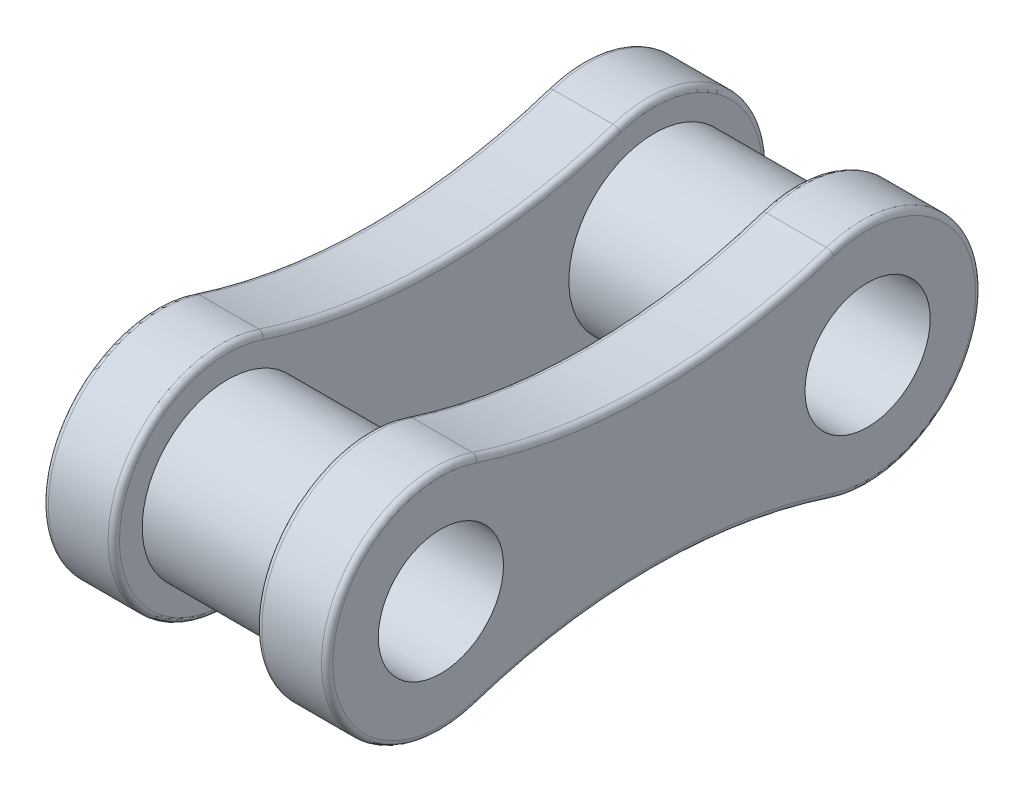
ISO-10303-21;
HEADER;
FILE_DESCRIPTION(('STEP AP214'),'2;1');
FILE_NAME('part.step','',(''),(''),'','','');
FILE_SCHEMA(('AUTOMOTIVE_DESIGN { 1 0 10303 214 1 1 1 1 }'));
ENDSEC;
DATA;
#1=APPLICATION_CONTEXT('core data for automotive mechanical design processes');
#2=APPLICATION_PROTOCOL_DEFINITION('international standard','automotive_design',2000,#1);
#3=PRODUCT_CONTEXT('',#1,'mechanical');
#4=PRODUCT('Part','Part','',(#3));
#5=PRODUCT_RELATED_PRODUCT_CATEGORY('part','',(#4));
#6=PRODUCT_DEFINITION_FORMATION('','',#4);
#7=PRODUCT_DEFINITION_CONTEXT('part definition',#1,'design');
#8=PRODUCT_DEFINITION('design','',#6,#7);
#9=PRODUCT_DEFINITION_SHAPE('','',#8);
#10=(LENGTH_UNIT() NAMED_UNIT(*) SI_UNIT(.MILLI.,.METRE.));
#11=(NAMED_UNIT(*) PLANE_ANGLE_UNIT() SI_UNIT($,.RADIAN.));
#12=(NAMED_UNIT(*) SI_UNIT($,.STERADIAN.) SOLID_ANGLE_UNIT());
#13=UNCERTAINTY_MEASURE_WITH_UNIT(LENGTH_MEASURE(1.E-05),#10,'distance_accuracy_value','');
#14=(GEOMETRIC_REPRESENTATION_CONTEXT(3) GLOBAL_UNCERTAINTY_ASSIGNED_CONTEXT((#13)) GLOBAL_UNIT_ASSIGNED_CONTEXT((#10,
#11,#12)) REPRESENTATION_CONTEXT('',''));
#15=CARTESIAN_POINT('',(0.,0.,0.));
#16=DIRECTION('',(0.,0.,1.));
#17=DIRECTION('',(1.,0.,0.));
#18=AXIS2_PLACEMENT_3D('',#15,#16,#17);
#19=CARTESIAN_POINT('',(6.35,-28.9534933125521,-9.525));
#20=DIRECTION('',(1.,0.,0.));
#21=DIRECTION('',(0.,0.,-1.));
#22=AXIS2_PLACEMENT_3D('',#19,#20,#21);
#23=PLANE('',#22);
#24=CARTESIAN_POINT('',(6.35,-57.9069866251042,-19.05));
#25=DIRECTION('',(1.,0.,0.));
#26=DIRECTION('',(0.,0.,-1.));
#27=AXIS2_PLACEMENT_3D('',#24,#25,#26);
#28=CIRCLE('',#27,51.308);
#29=CARTESIAN_POINT('',(6.35,-9.16860621564149,-35.08375));
#30=VERTEX_POINT('',#29);
#31=CARTESIAN_POINT('',(6.35,-9.1686062156415,-3.01624999999999));
#32=VERTEX_POINT('',#31);
#33=EDGE_CURVE('E326',#30,#32,#28,.T.);
#34=ORIENTED_EDGE('',*,*,#33,.T.);
#35=CARTESIAN_POINT('',(6.35,0.,0.));
#36=DIRECTION('',(1.,0.,0.));
#37=DIRECTION('',(0.,0.,-1.));
#38=AXIS2_PLACEMENT_3D('',#35,#36,#37);
#39=CIRCLE('',#38,9.65199999999999);
#40=CARTESIAN_POINT('',(6.35,9.12571738781709,-3.1436262751308));
#41=VERTEX_POINT('',#40);
#42=EDGE_CURVE('E319',#32,#41,#39,.F.);
#43=ORIENTED_EDGE('',*,*,#42,.T.);
#44=CARTESIAN_POINT('',(6.35,10.0863192181136,-3.47453430409194));
#45=DIRECTION('',(1.,0.,0.));
#46=DIRECTION('',(0.,0.,-1.));
#47=AXIS2_PLACEMENT_3D('',#44,#45,#46);
#48=CIRCLE('',#47,1.016);
#49=CARTESIAN_POINT('',(6.35,9.12025851420993,-3.15991911632581));
#50=VERTEX_POINT('',#49);
#51=EDGE_CURVE('E323',#50,#41,#48,.F.);
#52=ORIENTED_EDGE('',*,*,#51,.F.);
#53=CARTESIAN_POINT('',(6.35,57.9063240613461,-19.0479860985152));
#54=DIRECTION('',(1.,0.,0.));
#55=DIRECTION('',(0.,0.,-1.));
#56=AXIS2_PLACEMENT_3D('',#53,#54,#55);
#57=CIRCLE('',#56,51.308);
#58=CARTESIAN_POINT('',(6.35,9.16850130971312,-35.0834311322649));
#59=VERTEX_POINT('',#58);
#60=EDGE_CURVE('E332',#50,#59,#57,.T.);
#61=ORIENTED_EDGE('',*,*,#60,.T.);
#62=CARTESIAN_POINT('',(6.35,0.,-38.1));
#63=DIRECTION('',(1.,0.,0.));
#64=DIRECTION('',(0.,0.,-1.));
#65=AXIS2_PLACEMENT_3D('',#62,#63,#64);
#66=CIRCLE('',#65,9.65199999999999);
#67=EDGE_CURVE('E329',#59,#30,#66,.F.);
#68=ORIENTED_EDGE('',*,*,#67,.T.);
#69=EDGE_LOOP('',(#34,#43,#52,#61,#68));
#70=FACE_BOUND('',#69,.T.);
#71=CARTESIAN_POINT('',(6.35,0.,0.));
#72=DIRECTION('',(1.,0.,0.));
#73=DIRECTION('',(0.,0.,-1.));
#74=AXIS2_PLACEMENT_3D('',#71,#72,#73);
#75=CIRCLE('',#74,7.62);
#76=CARTESIAN_POINT('',(6.35,0.,-7.62));
#77=VERTEX_POINT('',#76);
#78=EDGE_CURVE('E422',#77,#77,#75,.T.);
#79=ORIENTED_EDGE('',*,*,#78,.T.);
#80=EDGE_LOOP('',(#79));
#81=FACE_BOUND('',#80,.T.);
#82=CARTESIAN_POINT('',(6.35,0.,-38.1));
#83=DIRECTION('',(1.,0.,0.));
#84=DIRECTION('',(0.,0.,-1.));
#85=AXIS2_PLACEMENT_3D('',#82,#83,#84);
#86=CIRCLE('',#85,7.62);
#87=CARTESIAN_POINT('',(6.35,0.,-45.72));
#88=VERTEX_POINT('',#87);
#89=EDGE_CURVE('E207',#88,#88,#86,.F.);
#90=ORIENTED_EDGE('',*,*,#89,.F.);
#91=EDGE_LOOP('',(#90));
#92=FACE_BOUND('',#91,.T.);
#93=ADVANCED_FACE('F44',(#70,#81,#92),#23,.F.);
#94=CARTESIAN_POINT('',(6.35,0.,0.));
#95=DIRECTION('',(-1.,0.,0.));
#96=DIRECTION('',(0.,0.,1.));
#97=AXIS2_PLACEMENT_3D('',#94,#95,#96);
#98=CYLINDRICAL_SURFACE('',#97,7.62);
#99=ORIENTED_EDGE('',*,*,#78,.F.);
#100=EDGE_LOOP('',(#99));
#101=FACE_BOUND('',#100,.T.);
#102=CARTESIAN_POINT('',(-6.35,0.,0.));
#103=DIRECTION('',(1.,0.,0.));
#104=DIRECTION('',(0.,0.,-1.));
#105=AXIS2_PLACEMENT_3D('',#102,#103,#104);
#106=CIRCLE('',#105,7.62);
#107=CARTESIAN_POINT('',(-6.35,0.,-7.62));
#108=VERTEX_POINT('',#107);
#109=EDGE_CURVE('E423',#108,#108,#106,.T.);
#110=ORIENTED_EDGE('',*,*,#109,.T.);
#111=EDGE_LOOP('',(#110));
#112=FACE_BOUND('',#111,.T.);
#113=ADVANCED_FACE('F490',(#101,#112),#98,.T.);
#114=CARTESIAN_POINT('',(6.35,0.,0.));
#115=DIRECTION('',(-1.,0.,0.));
#116=DIRECTION('',(0.,0.,1.));
#117=AXIS2_PLACEMENT_3D('',#114,#115,#116);
#118=CYLINDRICAL_SURFACE('',#117,5.588);
#119=CARTESIAN_POINT('',(12.7,0.,0.));
#120=DIRECTION('',(1.,0.,0.));
#121=DIRECTION('',(0.,0.,-1.));
#122=AXIS2_PLACEMENT_3D('',#119,#120,#121);
#123=CIRCLE('',#122,5.588);
#124=CARTESIAN_POINT('',(12.7,0.,-5.588));
#125=VERTEX_POINT('',#124);
#126=EDGE_CURVE('E427',#125,#125,#123,.T.);
#127=ORIENTED_EDGE('',*,*,#126,.T.);
#128=EDGE_LOOP('',(#127));
#129=FACE_BOUND('',#128,.T.);
#130=CARTESIAN_POINT('',(-12.7,0.,0.));
#131=DIRECTION('',(-1.,0.,0.));
#132=DIRECTION('',(0.,0.,1.));
#133=AXIS2_PLACEMENT_3D('',#130,#131,#132);
#134=CIRCLE('',#133,5.588);
#135=CARTESIAN_POINT('',(-12.7,0.,5.588));
#136=VERTEX_POINT('',#135);
#137=EDGE_CURVE('E248',#136,#136,#134,.T.);
#138=ORIENTED_EDGE('',*,*,#137,.T.);
#139=EDGE_LOOP('',(#138));
#140=FACE_BOUND('',#139,.T.);
#141=ADVANCED_FACE('F473',(#129,#140),#118,.F.);
#142=CARTESIAN_POINT('',(12.7,-28.9534933125521,-9.525));
#143=DIRECTION('',(1.,0.,0.));
#144=DIRECTION('',(0.,0.,-1.));
#145=AXIS2_PLACEMENT_3D('',#142,#143,#144);
#146=PLANE('',#145);
#147=CARTESIAN_POINT('',(12.7,10.0863192181136,-3.47453430409194));
#148=DIRECTION('',(1.,0.,0.));
#149=DIRECTION('',(0.,0.,-1.));
#150=AXIS2_PLACEMENT_3D('',#147,#148,#149);
#151=CIRCLE('',#150,1.016);
#152=CARTESIAN_POINT('',(12.7,9.12571738781709,-3.1436262751308));
#153=VERTEX_POINT('',#152);
#154=CARTESIAN_POINT('',(12.7,9.12025851420993,-3.15991911632581));
#155=VERTEX_POINT('',#154);
#156=EDGE_CURVE('E370',#153,#155,#151,.T.);
#157=ORIENTED_EDGE('',*,*,#156,.F.);
#158=CARTESIAN_POINT('',(12.7,0.,0.));
#159=DIRECTION('',(1.,0.,0.));
#160=DIRECTION('',(0.,0.,-1.));
#161=AXIS2_PLACEMENT_3D('',#158,#159,#160);
#162=CIRCLE('',#161,9.65199999999999);
#163=CARTESIAN_POINT('',(12.7,-9.1686062156415,-3.01624999999999));
#164=VERTEX_POINT('',#163);
#165=EDGE_CURVE('E357',#153,#164,#162,.T.);
#166=ORIENTED_EDGE('',*,*,#165,.T.);
#167=CARTESIAN_POINT('',(12.7,-57.9069866251042,-19.05));
#168=DIRECTION('',(1.,0.,0.));
#169=DIRECTION('',(0.,0.,-1.));
#170=AXIS2_PLACEMENT_3D('',#167,#168,#169);
#171=CIRCLE('',#170,51.308);
#172=CARTESIAN_POINT('',(12.7,-9.16860621564149,-35.08375));
#173=VERTEX_POINT('',#172);
#174=EDGE_CURVE('E361',#164,#173,#171,.F.);
#175=ORIENTED_EDGE('',*,*,#174,.T.);
#176=CARTESIAN_POINT('',(12.7,0.,-38.1));
#177=DIRECTION('',(1.,0.,0.));
#178=DIRECTION('',(0.,0.,-1.));
#179=AXIS2_PLACEMENT_3D('',#176,#177,#178);
#180=CIRCLE('',#179,9.65199999999999);
#181=CARTESIAN_POINT('',(12.7,9.16850130971312,-35.0834311322649));
#182=VERTEX_POINT('',#181);
#183=EDGE_CURVE('E364',#173,#182,#180,.T.);
#184=ORIENTED_EDGE('',*,*,#183,.T.);
#185=CARTESIAN_POINT('',(12.7,57.9063240613461,-19.0479860985152));
#186=DIRECTION('',(1.,0.,0.));
#187=DIRECTION('',(0.,0.,-1.));
#188=AXIS2_PLACEMENT_3D('',#185,#186,#187);
#189=CIRCLE('',#188,51.308);
#190=EDGE_CURVE('E367',#182,#155,#189,.F.);
#191=ORIENTED_EDGE('',*,*,#190,.T.);
#192=EDGE_LOOP('',(#157,#166,#175,#184,#191));
#193=FACE_BOUND('',#192,.T.);
#194=CARTESIAN_POINT('',(12.7,0.,-38.1));
#195=DIRECTION('',(1.,0.,0.));
#196=DIRECTION('',(0.,0.,-1.));
#197=AXIS2_PLACEMENT_3D('',#194,#195,#196);
#198=CIRCLE('',#197,5.588);
#199=CARTESIAN_POINT('',(12.7,0.,-43.688));
#200=VERTEX_POINT('',#199);
#201=EDGE_CURVE('E443',#200,#200,#198,.T.);
#202=ORIENTED_EDGE('',*,*,#201,.F.);
#203=EDGE_LOOP('',(#202));
#204=FACE_BOUND('',#203,.T.);
#205=ORIENTED_EDGE('',*,*,#126,.F.);
#206=EDGE_LOOP('',(#205));
#207=FACE_BOUND('',#206,.T.);
#208=ADVANCED_FACE('F501',(#193,#204,#207),#146,.T.);
#209=CARTESIAN_POINT('',(12.7,-57.9069866251042,-19.05));
#210=DIRECTION('',(-1.,0.,0.));
#211=DIRECTION('',(0.,0.,1.));
#212=AXIS2_PLACEMENT_3D('',#209,#210,#211);
#213=CYLINDRICAL_SURFACE('',#212,50.8);
#214=DIRECTION('',(-1.,0.,0.));
#215=VECTOR('',#214,1.);
#216=CARTESIAN_POINT('',(12.7,-9.65116443751736,-34.925));
#217=LINE('',#216,#215);
#218=CARTESIAN_POINT('',(12.192,-9.65116443751736,-34.925));
#219=VERTEX_POINT('',#218);
#220=CARTESIAN_POINT('',(6.858,-9.65116443751736,-34.925));
#221=VERTEX_POINT('',#220);
#222=EDGE_CURVE('E432',#219,#221,#217,.T.);
#223=ORIENTED_EDGE('',*,*,#222,.F.);
#224=CARTESIAN_POINT('',(12.192,-57.9069866251042,-19.05));
#225=DIRECTION('',(1.,0.,0.));
#226=DIRECTION('',(0.,0.,-1.));
#227=AXIS2_PLACEMENT_3D('',#224,#225,#226);
#228=CIRCLE('',#227,50.8);
#229=CARTESIAN_POINT('',(12.192,-9.65116443751737,-3.17499999999999));
#230=VERTEX_POINT('',#229);
#231=EDGE_CURVE('E341',#219,#230,#228,.T.);
#232=ORIENTED_EDGE('',*,*,#231,.T.);
#233=DIRECTION('',(-1.,0.,0.));
#234=VECTOR('',#233,1.);
#235=CARTESIAN_POINT('',(12.7,-9.65116443751737,-3.17499999999999));
#236=LINE('',#235,#234);
#237=CARTESIAN_POINT('',(6.858,-9.65116443751737,-3.17499999999999));
#238=VERTEX_POINT('',#237);
#239=EDGE_CURVE('E439',#230,#238,#236,.T.);
#240=ORIENTED_EDGE('',*,*,#239,.T.);
#241=CARTESIAN_POINT('',(6.858,-57.9069866251042,-19.05));
#242=DIRECTION('',(1.,0.,0.));
#243=DIRECTION('',(0.,0.,-1.));
#244=AXIS2_PLACEMENT_3D('',#241,#242,#243);
#245=CIRCLE('',#244,50.8);
#246=EDGE_CURVE('E344',#238,#221,#245,.F.);
#247=ORIENTED_EDGE('',*,*,#246,.T.);
#248=EDGE_LOOP('',(#223,#232,#240,#247));
#249=FACE_BOUND('',#248,.T.);
#250=ADVANCED_FACE('F513',(#249),#213,.F.);
#251=CARTESIAN_POINT('',(12.7,0.,-38.1));
#252=DIRECTION('',(-1.,0.,0.));
#253=DIRECTION('',(0.,0.,1.));
#254=AXIS2_PLACEMENT_3D('',#251,#252,#253);
#255=CYLINDRICAL_SURFACE('',#254,10.16);
#256=DIRECTION('',(-1.,0.,0.));
#257=VECTOR('',#256,1.);
#258=CARTESIAN_POINT('',(12.7,9.65105401022434,-34.9246643497525));
#259=LINE('',#258,#257);
#260=CARTESIAN_POINT('',(12.192,9.65105401022434,-34.9246643497525));
#261=VERTEX_POINT('',#260);
#262=CARTESIAN_POINT('',(6.858,9.65105401022434,-34.9246643497525));
#263=VERTEX_POINT('',#262);
#264=EDGE_CURVE('E436',#261,#263,#259,.T.);
#265=ORIENTED_EDGE('',*,*,#264,.F.);
#266=CARTESIAN_POINT('',(12.192,0.,-38.1));
#267=DIRECTION('',(1.,0.,0.));
#268=DIRECTION('',(0.,0.,-1.));
#269=AXIS2_PLACEMENT_3D('',#266,#267,#268);
#270=CIRCLE('',#269,10.16);
#271=EDGE_CURVE('E335',#261,#219,#270,.F.);
#272=ORIENTED_EDGE('',*,*,#271,.T.);
#273=ORIENTED_EDGE('',*,*,#222,.T.);
#274=CARTESIAN_POINT('',(6.858,0.,-38.1));
#275=DIRECTION('',(1.,0.,0.));
#276=DIRECTION('',(0.,0.,-1.));
#277=AXIS2_PLACEMENT_3D('',#274,#275,#276);
#278=CIRCLE('',#277,10.16);
#279=EDGE_CURVE('E338',#221,#263,#278,.T.);
#280=ORIENTED_EDGE('',*,*,#279,.T.);
#281=EDGE_LOOP('',(#265,#272,#273,#280));
#282=FACE_BOUND('',#281,.T.);
#283=ADVANCED_FACE('F510',(#282),#255,.T.);
#284=CARTESIAN_POINT('',(12.7,57.9063240613461,-19.0479860985152));
#285=DIRECTION('',(-1.,0.,0.));
#286=DIRECTION('',(0.,0.,1.));
#287=AXIS2_PLACEMENT_3D('',#284,#285,#286);
#288=CYLINDRICAL_SURFACE('',#287,50.8);
#289=DIRECTION('',(-1.,0.,0.));
#290=VECTOR('',#289,1.);
#291=CARTESIAN_POINT('',(12.7,9.60328886616177,-3.31722671020887));
#292=LINE('',#291,#290);
#293=CARTESIAN_POINT('',(6.858,9.60328886616178,-3.31722671020887));
#294=VERTEX_POINT('',#293);
#295=CARTESIAN_POINT('',(12.192,9.60328886616178,-3.31722671020887));
#296=VERTEX_POINT('',#295);
#297=EDGE_CURVE('E54',#294,#296,#292,.F.);
#298=ORIENTED_EDGE('',*,*,#297,.T.);
#299=CARTESIAN_POINT('',(12.192,57.9063240613461,-19.0479860985152));
#300=DIRECTION('',(1.,0.,0.));
#301=DIRECTION('',(0.,0.,-1.));
#302=AXIS2_PLACEMENT_3D('',#299,#300,#301);
#303=CIRCLE('',#302,50.8);
#304=EDGE_CURVE('E11',#296,#261,#303,.T.);
#305=ORIENTED_EDGE('',*,*,#304,.T.);
#306=ORIENTED_EDGE('',*,*,#264,.T.);
#307=CARTESIAN_POINT('',(6.858,57.9063240613461,-19.0479860985152));
#308=DIRECTION('',(1.,0.,0.));
#309=DIRECTION('',(0.,0.,-1.));
#310=AXIS2_PLACEMENT_3D('',#307,#308,#309);
#311=CIRCLE('',#310,50.8);
#312=EDGE_CURVE('E65',#263,#294,#311,.F.);
#313=ORIENTED_EDGE('',*,*,#312,.T.);
#314=EDGE_LOOP('',(#298,#305,#306,#313));
#315=FACE_BOUND('',#314,.T.);
#316=ADVANCED_FACE('F506',(#315),#288,.F.);
#317=CARTESIAN_POINT('',(12.7,0.,0.));
#318=DIRECTION('',(-1.,0.,0.));
#319=DIRECTION('',(0.,0.,1.));
#320=AXIS2_PLACEMENT_3D('',#317,#318,#319);
#321=CYLINDRICAL_SURFACE('',#320,10.16);
#322=ORIENTED_EDGE('',*,*,#239,.F.);
#323=CARTESIAN_POINT('',(12.192,0.,0.));
#324=DIRECTION('',(1.,0.,0.));
#325=DIRECTION('',(0.,0.,-1.));
#326=AXIS2_PLACEMENT_3D('',#323,#324,#325);
#327=CIRCLE('',#326,10.16);
#328=CARTESIAN_POINT('',(12.192,9.60601830296535,-3.30908028961137));
#329=VERTEX_POINT('',#328);
#330=EDGE_CURVE('E347',#230,#329,#327,.F.);
#331=ORIENTED_EDGE('',*,*,#330,.T.);
#332=DIRECTION('',(-1.,0.,0.));
#333=VECTOR('',#332,1.);
#334=CARTESIAN_POINT('',(12.7,9.60601830296535,-3.30908028961137));
#335=LINE('',#334,#333);
#336=CARTESIAN_POINT('',(6.858,9.60601830296535,-3.30908028961137));
#337=VERTEX_POINT('',#336);
#338=EDGE_CURVE('E354',#329,#337,#335,.T.);
#339=ORIENTED_EDGE('',*,*,#338,.T.);
#340=CARTESIAN_POINT('',(6.858,0.,0.));
#341=DIRECTION('',(1.,0.,0.));
#342=DIRECTION('',(0.,0.,-1.));
#343=AXIS2_PLACEMENT_3D('',#340,#341,#342);
#344=CIRCLE('',#343,10.16);
#345=EDGE_CURVE('E351',#337,#238,#344,.T.);
#346=ORIENTED_EDGE('',*,*,#345,.T.);
#347=EDGE_LOOP('',(#322,#331,#339,#346));
#348=FACE_BOUND('',#347,.T.);
#349=ADVANCED_FACE('F503',(#348),#321,.T.);
#350=CARTESIAN_POINT('',(12.7,0.,-38.1));
#351=DIRECTION('',(-1.,0.,0.));
#352=DIRECTION('',(0.,0.,1.));
#353=AXIS2_PLACEMENT_3D('',#350,#351,#352);
#354=CYLINDRICAL_SURFACE('',#353,5.588);
#355=ORIENTED_EDGE('',*,*,#201,.T.);
#356=EDGE_LOOP('',(#355));
#357=FACE_BOUND('',#356,.T.);
#358=CARTESIAN_POINT('',(-12.7,0.,-38.1));
#359=DIRECTION('',(-1.,0.,0.));
#360=DIRECTION('',(0.,0.,1.));
#361=AXIS2_PLACEMENT_3D('',#358,#359,#360);
#362=CIRCLE('',#361,5.588);
#363=CARTESIAN_POINT('',(-12.7,0.,-32.512));
#364=VERTEX_POINT('',#363);
#365=EDGE_CURVE('E465',#364,#364,#362,.T.);
#366=ORIENTED_EDGE('',*,*,#365,.T.);
#367=EDGE_LOOP('',(#366));
#368=FACE_BOUND('',#367,.T.);
#369=ADVANCED_FACE('F486',(#357,#368),#354,.F.);
#370=CARTESIAN_POINT('',(6.35,0.,-38.1));
#371=DIRECTION('',(-1.,0.,0.));
#372=DIRECTION('',(0.,0.,1.));
#373=AXIS2_PLACEMENT_3D('',#370,#371,#372);
#374=CYLINDRICAL_SURFACE('',#373,7.62);
#375=ORIENTED_EDGE('',*,*,#89,.T.);
#376=EDGE_LOOP('',(#375));
#377=FACE_BOUND('',#376,.T.);
#378=CARTESIAN_POINT('',(-6.35,0.,-38.1));
#379=DIRECTION('',(1.,0.,0.));
#380=DIRECTION('',(0.,0.,-1.));
#381=AXIS2_PLACEMENT_3D('',#378,#379,#380);
#382=CIRCLE('',#381,7.62);
#383=CARTESIAN_POINT('',(-6.35,0.,-45.72));
#384=VERTEX_POINT('',#383);
#385=EDGE_CURVE('E428',#384,#384,#382,.T.);
#386=ORIENTED_EDGE('',*,*,#385,.T.);
#387=EDGE_LOOP('',(#386));
#388=FACE_BOUND('',#387,.T.);
#389=ADVANCED_FACE('F477',(#377,#388),#374,.T.);
#390=CARTESIAN_POINT('',(-12.7,-28.9534933125521,-28.575));
#391=DIRECTION('',(-1.,0.,0.));
#392=DIRECTION('',(0.,0.,1.));
#393=AXIS2_PLACEMENT_3D('',#390,#391,#392);
#394=PLANE('',#393);
#395=CARTESIAN_POINT('',(-12.7,-57.9069866251042,-19.05));
#396=DIRECTION('',(-1.,0.,0.));
#397=DIRECTION('',(0.,0.,1.));
#398=AXIS2_PLACEMENT_3D('',#395,#396,#397);
#399=CIRCLE('',#398,51.308);
#400=CARTESIAN_POINT('',(-12.7,-9.16860621564149,-35.08375));
#401=VERTEX_POINT('',#400);
#402=CARTESIAN_POINT('',(-12.7,-9.1686062156415,-3.01624999999999));
#403=VERTEX_POINT('',#402);
#404=EDGE_CURVE('E194',#401,#403,#399,.F.);
#405=ORIENTED_EDGE('',*,*,#404,.T.);
#406=CARTESIAN_POINT('',(-12.7,0.,0.));
#407=DIRECTION('',(-1.,0.,0.));
#408=DIRECTION('',(0.,0.,1.));
#409=AXIS2_PLACEMENT_3D('',#406,#407,#408);
#410=CIRCLE('',#409,9.65199999999999);
#411=CARTESIAN_POINT('',(-12.7,9.12571738781698,-3.14362627513112));
#412=VERTEX_POINT('',#411);
#413=EDGE_CURVE('E189',#403,#412,#410,.T.);
#414=ORIENTED_EDGE('',*,*,#413,.T.);
#415=CARTESIAN_POINT('',(-12.7,10.0863192181135,-3.47453430409229));
#416=DIRECTION('',(-1.,0.,0.));
#417=DIRECTION('',(0.,0.,1.));
#418=AXIS2_PLACEMENT_3D('',#415,#416,#417);
#419=CIRCLE('',#418,1.016);
#420=CARTESIAN_POINT('',(-12.7,9.12025851420982,-3.15991911632616));
#421=VERTEX_POINT('',#420);
#422=EDGE_CURVE('E182',#421,#412,#419,.T.);
#423=ORIENTED_EDGE('',*,*,#422,.F.);
#424=CARTESIAN_POINT('',(-12.7,57.9063240613461,-19.0479860985152));
#425=DIRECTION('',(-1.,0.,0.));
#426=DIRECTION('',(0.,0.,1.));
#427=AXIS2_PLACEMENT_3D('',#424,#425,#426);
#428=CIRCLE('',#427,51.308);
#429=CARTESIAN_POINT('',(-12.7,9.16850130971313,-35.0834311322649));
#430=VERTEX_POINT('',#429);
#431=EDGE_CURVE('E186',#421,#430,#428,.F.);
#432=ORIENTED_EDGE('',*,*,#431,.T.);
#433=CARTESIAN_POINT('',(-12.7,0.,-38.1));
#434=DIRECTION('',(-1.,0.,0.));
#435=DIRECTION('',(0.,0.,1.));
#436=AXIS2_PLACEMENT_3D('',#433,#434,#435);
#437=CIRCLE('',#436,9.65199999999999);
#438=EDGE_CURVE('E206',#430,#401,#437,.T.);
#439=ORIENTED_EDGE('',*,*,#438,.T.);
#440=EDGE_LOOP('',(#405,#414,#423,#432,#439));
#441=FACE_BOUND('',#440,.T.);
#442=ORIENTED_EDGE('',*,*,#365,.F.);
#443=EDGE_LOOP('',(#442));
#444=FACE_BOUND('',#443,.T.);
#445=ORIENTED_EDGE('',*,*,#137,.F.);
#446=EDGE_LOOP('',(#445));
#447=FACE_BOUND('',#446,.T.);
#448=ADVANCED_FACE('F184',(#441,#444,#447),#394,.T.);
#449=CARTESIAN_POINT('',(-6.35,-28.9534933125521,-28.575));
#450=DIRECTION('',(-1.,0.,0.));
#451=DIRECTION('',(0.,0.,1.));
#452=AXIS2_PLACEMENT_3D('',#449,#450,#451);
#453=PLANE('',#452);
#454=CARTESIAN_POINT('',(-6.35,10.0863192181135,-3.47453430409229));
#455=DIRECTION('',(-1.,0.,0.));
#456=DIRECTION('',(0.,0.,1.));
#457=AXIS2_PLACEMENT_3D('',#454,#455,#456);
#458=CIRCLE('',#457,1.016);
#459=CARTESIAN_POINT('',(-6.35,9.12571738781698,-3.14362627513112));
#460=VERTEX_POINT('',#459);
#461=CARTESIAN_POINT('',(-6.35,9.12025851420982,-3.15991911632616));
#462=VERTEX_POINT('',#461);
#463=EDGE_CURVE('E387',#460,#462,#458,.F.);
#464=ORIENTED_EDGE('',*,*,#463,.F.);
#465=CARTESIAN_POINT('',(-6.35,0.,0.));
#466=DIRECTION('',(-1.,0.,0.));
#467=DIRECTION('',(0.,0.,1.));
#468=AXIS2_PLACEMENT_3D('',#465,#466,#467);
#469=CIRCLE('',#468,9.65199999999999);
#470=CARTESIAN_POINT('',(-6.35,-9.1686062156415,-3.01624999999999));
#471=VERTEX_POINT('',#470);
#472=EDGE_CURVE('E374',#460,#471,#469,.F.);
#473=ORIENTED_EDGE('',*,*,#472,.T.);
#474=CARTESIAN_POINT('',(-6.35,-57.9069866251042,-19.05));
#475=DIRECTION('',(-1.,0.,0.));
#476=DIRECTION('',(0.,0.,1.));
#477=AXIS2_PLACEMENT_3D('',#474,#475,#476);
#478=CIRCLE('',#477,51.308);
#479=CARTESIAN_POINT('',(-6.35,-9.16860621564149,-35.08375));
#480=VERTEX_POINT('',#479);
#481=EDGE_CURVE('E378',#471,#480,#478,.T.);
#482=ORIENTED_EDGE('',*,*,#481,.T.);
#483=CARTESIAN_POINT('',(-6.35,0.,-38.1));
#484=DIRECTION('',(-1.,0.,0.));
#485=DIRECTION('',(0.,0.,1.));
#486=AXIS2_PLACEMENT_3D('',#483,#484,#485);
#487=CIRCLE('',#486,9.65199999999999);
#488=CARTESIAN_POINT('',(-6.35,9.16850130971313,-35.0834311322649));
#489=VERTEX_POINT('',#488);
#490=EDGE_CURVE('E381',#480,#489,#487,.F.);
#491=ORIENTED_EDGE('',*,*,#490,.T.);
#492=CARTESIAN_POINT('',(-6.35,57.9063240613461,-19.0479860985152));
#493=DIRECTION('',(-1.,0.,0.));
#494=DIRECTION('',(0.,0.,1.));
#495=AXIS2_PLACEMENT_3D('',#492,#493,#494);
#496=CIRCLE('',#495,51.308);
#497=EDGE_CURVE('E384',#489,#462,#496,.T.);
#498=ORIENTED_EDGE('',*,*,#497,.T.);
#499=EDGE_LOOP('',(#464,#473,#482,#491,#498));
#500=FACE_BOUND('',#499,.T.);
#501=ORIENTED_EDGE('',*,*,#109,.F.);
#502=EDGE_LOOP('',(#501));
#503=FACE_BOUND('',#502,.T.);
#504=ORIENTED_EDGE('',*,*,#385,.F.);
#505=EDGE_LOOP('',(#504));
#506=FACE_BOUND('',#505,.T.);
#507=ADVANCED_FACE('F476',(#500,#503,#506),#453,.F.);
#508=CARTESIAN_POINT('',(-12.7,-57.9069866251042,-19.05));
#509=DIRECTION('',(1.,0.,0.));
#510=DIRECTION('',(0.,0.,-1.));
#511=AXIS2_PLACEMENT_3D('',#508,#509,#510);
#512=CYLINDRICAL_SURFACE('',#511,50.8);
#513=DIRECTION('',(1.,0.,0.));
#514=VECTOR('',#513,1.);
#515=CARTESIAN_POINT('',(-12.7,-9.65116443751737,-3.17499999999999));
#516=LINE('',#515,#514);
#517=CARTESIAN_POINT('',(-12.192,-9.65116443751737,-3.17499999999999));
#518=VERTEX_POINT('',#517);
#519=CARTESIAN_POINT('',(-6.858,-9.65116443751737,-3.17499999999999));
#520=VERTEX_POINT('',#519);
#521=EDGE_CURVE('E453',#518,#520,#516,.T.);
#522=ORIENTED_EDGE('',*,*,#521,.F.);
#523=CARTESIAN_POINT('',(-12.192,-57.9069866251042,-19.05));
#524=DIRECTION('',(-1.,0.,0.));
#525=DIRECTION('',(0.,0.,1.));
#526=AXIS2_PLACEMENT_3D('',#523,#524,#525);
#527=CIRCLE('',#526,50.8);
#528=CARTESIAN_POINT('',(-12.192,-9.65116443751736,-34.925));
#529=VERTEX_POINT('',#528);
#530=EDGE_CURVE('E397',#518,#529,#527,.T.);
#531=ORIENTED_EDGE('',*,*,#530,.T.);
#532=DIRECTION('',(1.,0.,0.));
#533=VECTOR('',#532,1.);
#534=CARTESIAN_POINT('',(-12.7,-9.65116443751736,-34.925));
#535=LINE('',#534,#533);
#536=CARTESIAN_POINT('',(-6.858,-9.65116443751736,-34.925));
#537=VERTEX_POINT('',#536);
#538=EDGE_CURVE('E461',#529,#537,#535,.T.);
#539=ORIENTED_EDGE('',*,*,#538,.T.);
#540=CARTESIAN_POINT('',(-6.858,-57.9069866251042,-19.05));
#541=DIRECTION('',(-1.,0.,0.));
#542=DIRECTION('',(0.,0.,1.));
#543=AXIS2_PLACEMENT_3D('',#540,#541,#542);
#544=CIRCLE('',#543,50.8);
#545=EDGE_CURVE('E400',#537,#520,#544,.F.);
#546=ORIENTED_EDGE('',*,*,#545,.T.);
#547=EDGE_LOOP('',(#522,#531,#539,#546));
#548=FACE_BOUND('',#547,.T.);
#549=ADVANCED_FACE('F483',(#548),#512,.F.);
#550=CARTESIAN_POINT('',(-12.7,0.,0.));
#551=DIRECTION('',(1.,0.,0.));
#552=DIRECTION('',(0.,0.,-1.));
#553=AXIS2_PLACEMENT_3D('',#550,#551,#552);
#554=CYLINDRICAL_SURFACE('',#553,10.16);
#555=DIRECTION('',(1.,0.,0.));
#556=VECTOR('',#555,1.);
#557=CARTESIAN_POINT('',(-12.7,9.60601830296524,-3.3090802896117));
#558=LINE('',#557,#556);
#559=CARTESIAN_POINT('',(-6.858,9.60601830296524,-3.3090802896117));
#560=VERTEX_POINT('',#559);
#561=CARTESIAN_POINT('',(-12.192,9.60601830296524,-3.3090802896117));
#562=VERTEX_POINT('',#561);
#563=EDGE_CURVE('E410',#560,#562,#558,.F.);
#564=ORIENTED_EDGE('',*,*,#563,.T.);
#565=CARTESIAN_POINT('',(-12.192,0.,0.));
#566=DIRECTION('',(-1.,0.,0.));
#567=DIRECTION('',(0.,0.,1.));
#568=AXIS2_PLACEMENT_3D('',#565,#566,#567);
#569=CIRCLE('',#568,10.16);
#570=EDGE_CURVE('E403',#562,#518,#569,.F.);
#571=ORIENTED_EDGE('',*,*,#570,.T.);
#572=ORIENTED_EDGE('',*,*,#521,.T.);
#573=CARTESIAN_POINT('',(-6.858,0.,0.));
#574=DIRECTION('',(-1.,0.,0.));
#575=DIRECTION('',(0.,0.,1.));
#576=AXIS2_PLACEMENT_3D('',#573,#574,#575);
#577=CIRCLE('',#576,10.16);
#578=EDGE_CURVE('E407',#520,#560,#577,.T.);
#579=ORIENTED_EDGE('',*,*,#578,.T.);
#580=EDGE_LOOP('',(#564,#571,#572,#579));
#581=FACE_BOUND('',#580,.T.);
#582=ADVANCED_FACE('F641',(#581),#554,.T.);
#583=CARTESIAN_POINT('',(-12.7,57.9063240613461,-19.0479860985152));
#584=DIRECTION('',(1.,0.,0.));
#585=DIRECTION('',(0.,0.,-1.));
#586=AXIS2_PLACEMENT_3D('',#583,#584,#585);
#587=CYLINDRICAL_SURFACE('',#586,50.8);
#588=DIRECTION('',(1.,0.,0.));
#589=VECTOR('',#588,1.);
#590=CARTESIAN_POINT('',(-12.7,9.65105401022435,-34.9246643497525));
#591=LINE('',#590,#589);
#592=CARTESIAN_POINT('',(-12.192,9.65105401022435,-34.9246643497525));
#593=VERTEX_POINT('',#592);
#594=CARTESIAN_POINT('',(-6.858,9.65105401022435,-34.9246643497525));
#595=VERTEX_POINT('',#594);
#596=EDGE_CURVE('E457',#593,#595,#591,.T.);
#597=ORIENTED_EDGE('',*,*,#596,.F.);
#598=CARTESIAN_POINT('',(-12.192,57.9063240613461,-19.0479860985152));
#599=DIRECTION('',(-1.,0.,0.));
#600=DIRECTION('',(0.,0.,1.));
#601=AXIS2_PLACEMENT_3D('',#598,#599,#600);
#602=CIRCLE('',#601,50.8);
#603=CARTESIAN_POINT('',(-12.192,9.60328886616166,-3.31722671020922));
#604=VERTEX_POINT('',#603);
#605=EDGE_CURVE('E310',#593,#604,#602,.T.);
#606=ORIENTED_EDGE('',*,*,#605,.T.);
#607=DIRECTION('',(1.,0.,0.));
#608=VECTOR('',#607,1.);
#609=CARTESIAN_POINT('',(-12.7,9.60328886616166,-3.31722671020922));
#610=LINE('',#609,#608);
#611=CARTESIAN_POINT('',(-6.858,9.60328886616166,-3.31722671020922));
#612=VERTEX_POINT('',#611);
#613=EDGE_CURVE('E313',#604,#612,#610,.T.);
#614=ORIENTED_EDGE('',*,*,#613,.T.);
#615=CARTESIAN_POINT('',(-6.858,57.9063240613461,-19.0479860985152));
#616=DIRECTION('',(-1.,0.,0.));
#617=DIRECTION('',(0.,0.,1.));
#618=AXIS2_PLACEMENT_3D('',#615,#616,#617);
#619=CIRCLE('',#618,50.8);
#620=EDGE_CURVE('E316',#612,#595,#619,.F.);
#621=ORIENTED_EDGE('',*,*,#620,.T.);
#622=EDGE_LOOP('',(#597,#606,#614,#621));
#623=FACE_BOUND('',#622,.T.);
#624=ADVANCED_FACE('F645',(#623),#587,.F.);
#625=CARTESIAN_POINT('',(-12.7,0.,-38.1));
#626=DIRECTION('',(1.,0.,0.));
#627=DIRECTION('',(0.,0.,-1.));
#628=AXIS2_PLACEMENT_3D('',#625,#626,#627);
#629=CYLINDRICAL_SURFACE('',#628,10.16);
#630=ORIENTED_EDGE('',*,*,#538,.F.);
#631=CARTESIAN_POINT('',(-12.192,0.,-38.1));
#632=DIRECTION('',(-1.,0.,0.));
#633=DIRECTION('',(0.,0.,1.));
#634=AXIS2_PLACEMENT_3D('',#631,#632,#633);
#635=CIRCLE('',#634,10.16);
#636=EDGE_CURVE('E391',#529,#593,#635,.F.);
#637=ORIENTED_EDGE('',*,*,#636,.T.);
#638=ORIENTED_EDGE('',*,*,#596,.T.);
#639=CARTESIAN_POINT('',(-6.858,0.,-38.1));
#640=DIRECTION('',(-1.,0.,0.));
#641=DIRECTION('',(0.,0.,1.));
#642=AXIS2_PLACEMENT_3D('',#639,#640,#641);
#643=CIRCLE('',#642,10.16);
#644=EDGE_CURVE('E394',#595,#537,#643,.T.);
#645=ORIENTED_EDGE('',*,*,#644,.T.);
#646=EDGE_LOOP('',(#630,#637,#638,#645));
#647=FACE_BOUND('',#646,.T.);
#648=ADVANCED_FACE('F559',(#647),#629,.T.);
#649=CARTESIAN_POINT('',(-6.858,0.,-38.1));
#650=DIRECTION('',(-1.,0.,0.));
#651=DIRECTION('',(0.,0.,1.));
#652=AXIS2_PLACEMENT_3D('',#649,#650,#651);
#653=TOROIDAL_SURFACE('',#652,9.65199999999999,0.508);
#654=CARTESIAN_POINT('',(-6.858,9.16850130971313,-35.0834311322649));
#655=DIRECTION('',(0.,-0.312533036441677,0.949906890770114));
#656=DIRECTION('',(0.,-0.949906890770114,-0.312533036441678));
#657=AXIS2_PLACEMENT_3D('',#654,#655,#656);
#658=CIRCLE('',#657,0.508);
#659=EDGE_CURVE('E240',#489,#595,#658,.T.);
#660=ORIENTED_EDGE('',*,*,#659,.F.);
#661=ORIENTED_EDGE('',*,*,#490,.F.);
#662=CARTESIAN_POINT('',(-6.858,-9.16860621564149,-35.08375));
#663=DIRECTION('',(0.,0.312499999999998,0.949917759598167));
#664=DIRECTION('',(0.,-0.949917759598167,0.312499999999998));
#665=AXIS2_PLACEMENT_3D('',#662,#663,#664);
#666=CIRCLE('',#665,0.508);
#667=EDGE_CURVE('E244',#537,#480,#666,.T.);
#668=ORIENTED_EDGE('',*,*,#667,.F.);
#669=ORIENTED_EDGE('',*,*,#644,.F.);
#670=EDGE_LOOP('',(#660,#661,#668,#669));
#671=FACE_BOUND('',#670,.T.);
#672=ADVANCED_FACE('F555',(#671),#653,.T.);
#673=CARTESIAN_POINT('',(-6.858,-57.9069866251042,-19.05));
#674=DIRECTION('',(-1.,0.,0.));
#675=DIRECTION('',(0.,0.,1.));
#676=AXIS2_PLACEMENT_3D('',#673,#674,#675);
#677=TOROIDAL_SURFACE('',#676,51.308,0.508);
#678=ORIENTED_EDGE('',*,*,#667,.T.);
#679=ORIENTED_EDGE('',*,*,#481,.F.);
#680=CARTESIAN_POINT('',(-6.858,-9.1686062156415,-3.01624999999999));
#681=DIRECTION('',(0.,-0.3125,0.949917759598167));
#682=DIRECTION('',(0.,-0.949917759598167,-0.3125));
#683=AXIS2_PLACEMENT_3D('',#680,#681,#682);
#684=CIRCLE('',#683,0.508);
#685=EDGE_CURVE('E237',#520,#471,#684,.T.);
#686=ORIENTED_EDGE('',*,*,#685,.F.);
#687=ORIENTED_EDGE('',*,*,#545,.F.);
#688=EDGE_LOOP('',(#678,#679,#686,#687));
#689=FACE_BOUND('',#688,.T.);
#690=ADVANCED_FACE('F551',(#689),#677,.T.);
#691=CARTESIAN_POINT('',(-6.858,57.9063240613461,-19.0479860985152));
#692=DIRECTION('',(-1.,0.,0.));
#693=DIRECTION('',(0.,0.,1.));
#694=AXIS2_PLACEMENT_3D('',#691,#692,#693);
#695=TOROIDAL_SURFACE('',#694,51.308,0.508);
#696=ORIENTED_EDGE('',*,*,#659,.T.);
#697=ORIENTED_EDGE('',*,*,#620,.F.);
#698=CARTESIAN_POINT('',(-6.858,9.12025851420982,-3.15991911632616));
#699=DIRECTION('',(0.,0.309660617880038,0.950847149511504));
#700=DIRECTION('',(0.,-0.950847149511504,0.309660617880038));
#701=AXIS2_PLACEMENT_3D('',#698,#699,#700);
#702=CIRCLE('',#701,0.508);
#703=EDGE_CURVE('E233',#462,#612,#702,.T.);
#704=ORIENTED_EDGE('',*,*,#703,.F.);
#705=ORIENTED_EDGE('',*,*,#497,.F.);
#706=EDGE_LOOP('',(#696,#697,#704,#705));
#707=FACE_BOUND('',#706,.T.);
#708=ADVANCED_FACE('F547',(#707),#695,.T.);
#709=CARTESIAN_POINT('',(-6.858,0.,0.));
#710=DIRECTION('',(-1.,0.,0.));
#711=DIRECTION('',(0.,0.,1.));
#712=AXIS2_PLACEMENT_3D('',#709,#710,#711);
#713=TOROIDAL_SURFACE('',#712,9.65199999999999,0.508);
#714=ORIENTED_EDGE('',*,*,#685,.T.);
#715=ORIENTED_EDGE('',*,*,#472,.F.);
#716=CARTESIAN_POINT('',(-6.858,9.12571738781698,-3.14362627513112));
#717=DIRECTION('',(0.,-0.325696878898789,-0.945474242417839));
#718=DIRECTION('',(0.,0.945474242417839,-0.325696878898789));
#719=AXIS2_PLACEMENT_3D('',#716,#717,#718);
#720=CIRCLE('',#719,0.508);
#721=EDGE_CURVE('E229',#560,#460,#720,.T.);
#722=ORIENTED_EDGE('',*,*,#721,.F.);
#723=ORIENTED_EDGE('',*,*,#578,.F.);
#724=EDGE_LOOP('',(#714,#715,#722,#723));
#725=FACE_BOUND('',#724,.T.);
#726=ADVANCED_FACE('F543',(#725),#713,.T.);
#727=CARTESIAN_POINT('',(-6.858,10.0863192181135,-3.47453430409229));
#728=DIRECTION('',(-1.,0.,0.));
#729=DIRECTION('',(0.,0.,1.));
#730=AXIS2_PLACEMENT_3D('',#727,#728,#729);
#731=TOROIDAL_SURFACE('',#730,1.016,0.508);
#732=ORIENTED_EDGE('',*,*,#463,.T.);
#733=ORIENTED_EDGE('',*,*,#703,.T.);
#734=CARTESIAN_POINT('',(-6.858,10.0863192181135,-3.47453430409229));
#735=DIRECTION('',(-1.,0.,0.));
#736=DIRECTION('',(0.,0.,1.));
#737=AXIS2_PLACEMENT_3D('',#734,#735,#736);
#738=CIRCLE('',#737,0.508);
#739=EDGE_CURVE('E218',#560,#612,#738,.F.);
#740=ORIENTED_EDGE('',*,*,#739,.F.);
#741=ORIENTED_EDGE('',*,*,#721,.T.);
#742=EDGE_LOOP('',(#732,#733,#740,#741));
#743=FACE_BOUND('',#742,.T.);
#744=ADVANCED_FACE('F539',(#743),#731,.T.);
#745=CARTESIAN_POINT('',(-12.192,0.,-38.1));
#746=DIRECTION('',(-1.,0.,0.));
#747=DIRECTION('',(0.,0.,1.));
#748=AXIS2_PLACEMENT_3D('',#745,#746,#747);
#749=TOROIDAL_SURFACE('',#748,9.65199999999999,0.508);
#750=CARTESIAN_POINT('',(-12.192,-9.16860621564149,-35.08375));
#751=DIRECTION('',(0.,0.312499999999998,0.949917759598167));
#752=DIRECTION('',(0.,-0.949917759598167,0.312499999999998));
#753=AXIS2_PLACEMENT_3D('',#750,#751,#752);
#754=CIRCLE('',#753,0.508);
#755=EDGE_CURVE('E213',#401,#529,#754,.T.);
#756=ORIENTED_EDGE('',*,*,#755,.F.);
#757=ORIENTED_EDGE('',*,*,#438,.F.);
#758=CARTESIAN_POINT('',(-12.192,9.16850130971313,-35.0834311322649));
#759=DIRECTION('',(0.,-0.312533036441677,0.949906890770114));
#760=DIRECTION('',(0.,-0.949906890770114,-0.312533036441678));
#761=AXIS2_PLACEMENT_3D('',#758,#759,#760);
#762=CIRCLE('',#761,0.508);
#763=EDGE_CURVE('E204',#593,#430,#762,.T.);
#764=ORIENTED_EDGE('',*,*,#763,.F.);
#765=ORIENTED_EDGE('',*,*,#636,.F.);
#766=EDGE_LOOP('',(#756,#757,#764,#765));
#767=FACE_BOUND('',#766,.T.);
#768=ADVANCED_FACE('F536',(#767),#749,.T.);
#769=CARTESIAN_POINT('',(-12.192,57.9063240613461,-19.0479860985152));
#770=DIRECTION('',(-1.,0.,0.));
#771=DIRECTION('',(0.,0.,1.));
#772=AXIS2_PLACEMENT_3D('',#769,#770,#771);
#773=TOROIDAL_SURFACE('',#772,51.308,0.508);
#774=ORIENTED_EDGE('',*,*,#763,.T.);
#775=ORIENTED_EDGE('',*,*,#431,.F.);
#776=CARTESIAN_POINT('',(-12.192,9.12025851420982,-3.15991911632616));
#777=DIRECTION('',(0.,0.309660617880038,0.950847149511504));
#778=DIRECTION('',(0.,-0.950847149511504,0.309660617880038));
#779=AXIS2_PLACEMENT_3D('',#776,#777,#778);
#780=CIRCLE('',#779,0.508);
#781=EDGE_CURVE('E201',#604,#421,#780,.T.);
#782=ORIENTED_EDGE('',*,*,#781,.F.);
#783=ORIENTED_EDGE('',*,*,#605,.F.);
#784=EDGE_LOOP('',(#774,#775,#782,#783));
#785=FACE_BOUND('',#784,.T.);
#786=ADVANCED_FACE('F199',(#785),#773,.T.);
#787=CARTESIAN_POINT('',(-12.7,10.0863192181135,-3.47453430409229));
#788=DIRECTION('',(1.,0.,0.));
#789=DIRECTION('',(0.,0.,-1.));
#790=AXIS2_PLACEMENT_3D('',#787,#788,#789);
#791=CYLINDRICAL_SURFACE('',#790,0.508);
#792=ORIENTED_EDGE('',*,*,#739,.T.);
#793=ORIENTED_EDGE('',*,*,#613,.F.);
#794=CARTESIAN_POINT('',(-12.192,10.0863192181135,-3.47453430409229));
#795=DIRECTION('',(-1.,0.,0.));
#796=DIRECTION('',(0.,0.,1.));
#797=AXIS2_PLACEMENT_3D('',#794,#795,#796);
#798=CIRCLE('',#797,0.508);
#799=EDGE_CURVE('E211',#562,#604,#798,.F.);
#800=ORIENTED_EDGE('',*,*,#799,.F.);
#801=ORIENTED_EDGE('',*,*,#563,.F.);
#802=EDGE_LOOP('',(#792,#793,#800,#801));
#803=FACE_BOUND('',#802,.T.);
#804=ADVANCED_FACE('F529',(#803),#791,.F.);
#805=CARTESIAN_POINT('',(-12.192,-57.9069866251042,-19.05));
#806=DIRECTION('',(-1.,0.,0.));
#807=DIRECTION('',(0.,0.,1.));
#808=AXIS2_PLACEMENT_3D('',#805,#806,#807);
#809=TOROIDAL_SURFACE('',#808,51.308,0.508);
#810=ORIENTED_EDGE('',*,*,#755,.T.);
#811=ORIENTED_EDGE('',*,*,#530,.F.);
#812=CARTESIAN_POINT('',(-12.192,-9.1686062156415,-3.01624999999999));
#813=DIRECTION('',(0.,-0.312499999999999,0.949917759598167));
#814=DIRECTION('',(0.,-0.949917759598167,-0.312499999999999));
#815=AXIS2_PLACEMENT_3D('',#812,#813,#814);
#816=CIRCLE('',#815,0.508);
#817=EDGE_CURVE('E220',#403,#518,#816,.T.);
#818=ORIENTED_EDGE('',*,*,#817,.F.);
#819=ORIENTED_EDGE('',*,*,#404,.F.);
#820=EDGE_LOOP('',(#810,#811,#818,#819));
#821=FACE_BOUND('',#820,.T.);
#822=ADVANCED_FACE('F526',(#821),#809,.T.);
#823=CARTESIAN_POINT('',(-12.192,10.0863192181135,-3.47453430409229));
#824=DIRECTION('',(-1.,0.,0.));
#825=DIRECTION('',(0.,0.,1.));
#826=AXIS2_PLACEMENT_3D('',#823,#824,#825);
#827=TOROIDAL_SURFACE('',#826,1.016,0.508);
#828=ORIENTED_EDGE('',*,*,#781,.T.);
#829=ORIENTED_EDGE('',*,*,#422,.T.);
#830=CARTESIAN_POINT('',(-12.192,9.12571738781698,-3.14362627513112));
#831=DIRECTION('',(0.,-0.325696878898789,-0.945474242417839));
#832=DIRECTION('',(0.,0.945474242417839,-0.325696878898789));
#833=AXIS2_PLACEMENT_3D('',#830,#831,#832);
#834=CIRCLE('',#833,0.508);
#835=EDGE_CURVE('E295',#562,#412,#834,.F.);
#836=ORIENTED_EDGE('',*,*,#835,.F.);
#837=ORIENTED_EDGE('',*,*,#799,.T.);
#838=EDGE_LOOP('',(#828,#829,#836,#837));
#839=FACE_BOUND('',#838,.T.);
#840=ADVANCED_FACE('F209',(#839),#827,.T.);
#841=CARTESIAN_POINT('',(-12.192,0.,0.));
#842=DIRECTION('',(-1.,0.,0.));
#843=DIRECTION('',(0.,0.,1.));
#844=AXIS2_PLACEMENT_3D('',#841,#842,#843);
#845=TOROIDAL_SURFACE('',#844,9.65199999999999,0.508);
#846=ORIENTED_EDGE('',*,*,#817,.T.);
#847=ORIENTED_EDGE('',*,*,#570,.F.);
#848=ORIENTED_EDGE('',*,*,#835,.T.);
#849=ORIENTED_EDGE('',*,*,#413,.F.);
#850=EDGE_LOOP('',(#846,#847,#848,#849));
#851=FACE_BOUND('',#850,.T.);
#852=ADVANCED_FACE('F521',(#851),#845,.T.);
#853=CARTESIAN_POINT('',(6.858,-57.9069866251042,-19.05));
#854=DIRECTION('',(1.,0.,0.));
#855=DIRECTION('',(0.,0.,-1.));
#856=AXIS2_PLACEMENT_3D('',#853,#854,#855);
#857=TOROIDAL_SURFACE('',#856,51.308,0.508);
#858=CARTESIAN_POINT('',(6.858,-9.1686062156415,-3.01624999999999));
#859=DIRECTION('',(0.,-0.312499999999999,0.949917759598167));
#860=DIRECTION('',(0.,-0.949917759598167,-0.312499999999999));
#861=AXIS2_PLACEMENT_3D('',#858,#859,#860);
#862=CIRCLE('',#861,0.508);
#863=EDGE_CURVE('E286',#32,#238,#862,.T.);
#864=ORIENTED_EDGE('',*,*,#863,.F.);
#865=ORIENTED_EDGE('',*,*,#33,.F.);
#866=CARTESIAN_POINT('',(6.858,-9.16860621564149,-35.08375));
#867=DIRECTION('',(0.,-0.312499999999998,-0.949917759598167));
#868=DIRECTION('',(0.,0.949917759598167,-0.312499999999998));
#869=AXIS2_PLACEMENT_3D('',#866,#867,#868);
#870=CIRCLE('',#869,0.508);
#871=EDGE_CURVE('E48',#221,#30,#870,.T.);
#872=ORIENTED_EDGE('',*,*,#871,.F.);
#873=ORIENTED_EDGE('',*,*,#246,.F.);
#874=EDGE_LOOP('',(#864,#865,#872,#873));
#875=FACE_BOUND('',#874,.T.);
#876=ADVANCED_FACE('F46',(#875),#857,.T.);
#877=CARTESIAN_POINT('',(6.858,0.,-38.1));
#878=DIRECTION('',(1.,0.,0.));
#879=DIRECTION('',(0.,0.,-1.));
#880=AXIS2_PLACEMENT_3D('',#877,#878,#879);
#881=TOROIDAL_SURFACE('',#880,9.65199999999999,0.508);
#882=ORIENTED_EDGE('',*,*,#871,.T.);
#883=ORIENTED_EDGE('',*,*,#67,.F.);
#884=CARTESIAN_POINT('',(6.858,9.16850130971312,-35.0834311322649));
#885=DIRECTION('',(0.,-0.312533036441677,0.949906890770114));
#886=DIRECTION('',(0.,-0.949906890770114,-0.312533036441678));
#887=AXIS2_PLACEMENT_3D('',#884,#885,#886);
#888=CIRCLE('',#887,0.508);
#889=EDGE_CURVE('E283',#263,#59,#888,.T.);
#890=ORIENTED_EDGE('',*,*,#889,.F.);
#891=ORIENTED_EDGE('',*,*,#279,.F.);
#892=EDGE_LOOP('',(#882,#883,#890,#891));
#893=FACE_BOUND('',#892,.T.);
#894=ADVANCED_FACE('F595',(#893),#881,.T.);
#895=CARTESIAN_POINT('',(6.858,0.,0.));
#896=DIRECTION('',(1.,0.,0.));
#897=DIRECTION('',(0.,0.,-1.));
#898=AXIS2_PLACEMENT_3D('',#895,#896,#897);
#899=TOROIDAL_SURFACE('',#898,9.65199999999999,0.508);
#900=ORIENTED_EDGE('',*,*,#863,.T.);
#901=ORIENTED_EDGE('',*,*,#345,.F.);
#902=CARTESIAN_POINT('',(6.858,9.12571738781709,-3.1436262751308));
#903=DIRECTION('',(0.,-0.325696878898757,-0.94547424241785));
#904=DIRECTION('',(0.,0.94547424241785,-0.325696878898757));
#905=AXIS2_PLACEMENT_3D('',#902,#903,#904);
#906=CIRCLE('',#905,0.508);
#907=EDGE_CURVE('E279',#41,#337,#906,.T.);
#908=ORIENTED_EDGE('',*,*,#907,.F.);
#909=ORIENTED_EDGE('',*,*,#42,.F.);
#910=EDGE_LOOP('',(#900,#901,#908,#909));
#911=FACE_BOUND('',#910,.T.);
#912=ADVANCED_FACE('F592',(#911),#899,.T.);
#913=CARTESIAN_POINT('',(6.858,57.9063240613461,-19.0479860985152));
#914=DIRECTION('',(1.,0.,0.));
#915=DIRECTION('',(0.,0.,-1.));
#916=AXIS2_PLACEMENT_3D('',#913,#914,#915);
#917=TOROIDAL_SURFACE('',#916,51.308,0.508);
#918=ORIENTED_EDGE('',*,*,#889,.T.);
#919=ORIENTED_EDGE('',*,*,#60,.F.);
#920=CARTESIAN_POINT('',(6.858,9.12025851420993,-3.15991911632581));
#921=DIRECTION('',(0.,0.309660617880045,0.950847149511502));
#922=DIRECTION('',(0.,-0.950847149511502,0.309660617880045));
#923=AXIS2_PLACEMENT_3D('',#920,#921,#922);
#924=CIRCLE('',#923,0.508);
#925=EDGE_CURVE('E275',#294,#50,#924,.T.);
#926=ORIENTED_EDGE('',*,*,#925,.F.);
#927=ORIENTED_EDGE('',*,*,#312,.F.);
#928=EDGE_LOOP('',(#918,#919,#926,#927));
#929=FACE_BOUND('',#928,.T.);
#930=ADVANCED_FACE('F588',(#929),#917,.T.);
#931=CARTESIAN_POINT('',(6.858,10.0863192181136,-3.47453430409194));
#932=DIRECTION('',(1.,0.,0.));
#933=DIRECTION('',(0.,0.,-1.));
#934=AXIS2_PLACEMENT_3D('',#931,#932,#933);
#935=TOROIDAL_SURFACE('',#934,1.016,0.508);
#936=ORIENTED_EDGE('',*,*,#51,.T.);
#937=ORIENTED_EDGE('',*,*,#907,.T.);
#938=CARTESIAN_POINT('',(6.858,10.0863192181136,-3.47453430409194));
#939=DIRECTION('',(1.,0.,0.));
#940=DIRECTION('',(0.,0.,-1.));
#941=AXIS2_PLACEMENT_3D('',#938,#939,#940);
#942=CIRCLE('',#941,0.508);
#943=EDGE_CURVE('E271',#294,#337,#942,.F.);
#944=ORIENTED_EDGE('',*,*,#943,.F.);
#945=ORIENTED_EDGE('',*,*,#925,.T.);
#946=EDGE_LOOP('',(#936,#937,#944,#945));
#947=FACE_BOUND('',#946,.T.);
#948=ADVANCED_FACE('F584',(#947),#935,.T.);
#949=CARTESIAN_POINT('',(12.7,10.0863192181136,-3.47453430409194));
#950=DIRECTION('',(-1.,0.,0.));
#951=DIRECTION('',(0.,0.,1.));
#952=AXIS2_PLACEMENT_3D('',#949,#950,#951);
#953=CYLINDRICAL_SURFACE('',#952,0.508);
#954=ORIENTED_EDGE('',*,*,#943,.T.);
#955=ORIENTED_EDGE('',*,*,#338,.F.);
#956=CARTESIAN_POINT('',(12.192,10.0863192181136,-3.47453430409194));
#957=DIRECTION('',(1.,0.,0.));
#958=DIRECTION('',(0.,0.,-1.));
#959=AXIS2_PLACEMENT_3D('',#956,#957,#958);
#960=CIRCLE('',#959,0.508);
#961=EDGE_CURVE('E263',#296,#329,#960,.F.);
#962=ORIENTED_EDGE('',*,*,#961,.F.);
#963=ORIENTED_EDGE('',*,*,#297,.F.);
#964=EDGE_LOOP('',(#954,#955,#962,#963));
#965=FACE_BOUND('',#964,.T.);
#966=ADVANCED_FACE('F580',(#965),#953,.F.);
#967=CARTESIAN_POINT('',(12.192,57.9063240613461,-19.0479860985152));
#968=DIRECTION('',(1.,0.,0.));
#969=DIRECTION('',(0.,0.,-1.));
#970=AXIS2_PLACEMENT_3D('',#967,#968,#969);
#971=TOROIDAL_SURFACE('',#970,51.308,0.508);
#972=CARTESIAN_POINT('',(12.192,9.12025851420993,-3.15991911632581));
#973=DIRECTION('',(0.,0.309660617880045,0.950847149511502));
#974=DIRECTION('',(0.,-0.950847149511502,0.309660617880045));
#975=AXIS2_PLACEMENT_3D('',#972,#973,#974);
#976=CIRCLE('',#975,0.508);
#977=EDGE_CURVE('E259',#155,#296,#976,.T.);
#978=ORIENTED_EDGE('',*,*,#977,.F.);
#979=ORIENTED_EDGE('',*,*,#190,.F.);
#980=CARTESIAN_POINT('',(12.192,9.16850130971312,-35.0834311322649));
#981=DIRECTION('',(0.,0.312533036441677,-0.949906890770114));
#982=DIRECTION('',(0.,0.949906890770114,0.312533036441678));
#983=AXIS2_PLACEMENT_3D('',#980,#981,#982);
#984=CIRCLE('',#983,0.508);
#985=EDGE_CURVE('E267',#261,#182,#984,.T.);
#986=ORIENTED_EDGE('',*,*,#985,.F.);
#987=ORIENTED_EDGE('',*,*,#304,.F.);
#988=EDGE_LOOP('',(#978,#979,#986,#987));
#989=FACE_BOUND('',#988,.T.);
#990=ADVANCED_FACE('F576',(#989),#971,.T.);
#991=CARTESIAN_POINT('',(12.192,0.,-38.1));
#992=DIRECTION('',(1.,0.,0.));
#993=DIRECTION('',(0.,0.,-1.));
#994=AXIS2_PLACEMENT_3D('',#991,#992,#993);
#995=TOROIDAL_SURFACE('',#994,9.65199999999999,0.508);
#996=ORIENTED_EDGE('',*,*,#985,.T.);
#997=ORIENTED_EDGE('',*,*,#183,.F.);
#998=CARTESIAN_POINT('',(12.192,-9.16860621564149,-35.08375));
#999=DIRECTION('',(0.,0.312499999999999,0.949917759598167));
#1000=DIRECTION('',(0.,-0.949917759598167,0.312499999999999));
#1001=AXIS2_PLACEMENT_3D('',#998,#999,#1000);
#1002=CIRCLE('',#1001,0.508);
#1003=EDGE_CURVE('E255',#219,#173,#1002,.T.);
#1004=ORIENTED_EDGE('',*,*,#1003,.F.);
#1005=ORIENTED_EDGE('',*,*,#271,.F.);
#1006=EDGE_LOOP('',(#996,#997,#1004,#1005));
#1007=FACE_BOUND('',#1006,.T.);
#1008=ADVANCED_FACE('F572',(#1007),#995,.T.);
#1009=CARTESIAN_POINT('',(12.192,10.0863192181136,-3.47453430409194));
#1010=DIRECTION('',(1.,0.,0.));
#1011=DIRECTION('',(0.,0.,-1.));
#1012=AXIS2_PLACEMENT_3D('',#1009,#1010,#1011);
#1013=TOROIDAL_SURFACE('',#1012,1.016,0.508);
#1014=ORIENTED_EDGE('',*,*,#977,.T.);
#1015=ORIENTED_EDGE('',*,*,#961,.T.);
#1016=CARTESIAN_POINT('',(12.192,9.12571738781709,-3.1436262751308));
#1017=DIRECTION('',(0.,-0.325696878898757,-0.94547424241785));
#1018=DIRECTION('',(0.,0.94547424241785,-0.325696878898757));
#1019=AXIS2_PLACEMENT_3D('',#1016,#1017,#1018);
#1020=CIRCLE('',#1019,0.508);
#1021=EDGE_CURVE('E252',#153,#329,#1020,.F.);
#1022=ORIENTED_EDGE('',*,*,#1021,.F.);
#1023=ORIENTED_EDGE('',*,*,#156,.T.);
#1024=EDGE_LOOP('',(#1014,#1015,#1022,#1023));
#1025=FACE_BOUND('',#1024,.T.);
#1026=ADVANCED_FACE('F568',(#1025),#1013,.T.);
#1027=CARTESIAN_POINT('',(12.192,-57.9069866251042,-19.05));
#1028=DIRECTION('',(1.,0.,0.));
#1029=DIRECTION('',(0.,0.,-1.));
#1030=AXIS2_PLACEMENT_3D('',#1027,#1028,#1029);
#1031=TOROIDAL_SURFACE('',#1030,51.308,0.508);
#1032=ORIENTED_EDGE('',*,*,#1003,.T.);
#1033=ORIENTED_EDGE('',*,*,#174,.F.);
#1034=CARTESIAN_POINT('',(12.192,-9.1686062156415,-3.01624999999999));
#1035=DIRECTION('',(0.,-0.3125,0.949917759598167));
#1036=DIRECTION('',(0.,-0.949917759598167,-0.3125));
#1037=AXIS2_PLACEMENT_3D('',#1034,#1035,#1036);
#1038=CIRCLE('',#1037,0.508);
#1039=EDGE_CURVE('E249',#230,#164,#1038,.T.);
#1040=ORIENTED_EDGE('',*,*,#1039,.F.);
#1041=ORIENTED_EDGE('',*,*,#231,.F.);
#1042=EDGE_LOOP('',(#1032,#1033,#1040,#1041));
#1043=FACE_BOUND('',#1042,.T.);
#1044=ADVANCED_FACE('F564',(#1043),#1031,.T.);
#1045=CARTESIAN_POINT('',(12.192,0.,0.));
#1046=DIRECTION('',(1.,0.,0.));
#1047=DIRECTION('',(0.,0.,-1.));
#1048=AXIS2_PLACEMENT_3D('',#1045,#1046,#1047);
#1049=TOROIDAL_SURFACE('',#1048,9.65199999999999,0.508);
#1050=ORIENTED_EDGE('',*,*,#1021,.T.);
#1051=ORIENTED_EDGE('',*,*,#330,.F.);
#1052=ORIENTED_EDGE('',*,*,#1039,.T.);
#1053=ORIENTED_EDGE('',*,*,#165,.F.);
#1054=EDGE_LOOP('',(#1050,#1051,#1052,#1053));
#1055=FACE_BOUND('',#1054,.T.);
#1056=ADVANCED_FACE('F561',(#1055),#1049,.T.);
#1057=CLOSED_SHELL('',(#93,#113,#141,#208,#250,#283,#316,#349,#369,#389,#448,#507,#549,#582,
#624,#648,#672,#690,#708,#726,#744,#768,#786,#804,#822,#840,#852,#876,#894,#912,#930,#948,#966,
#990,#1008,#1026,#1044,#1056));
#1058=MANIFOLD_SOLID_BREP('B2',#1057);
#1059=ADVANCED_BREP_SHAPE_REPRESENTATION('',(#18,#1058),#14);
#1060=SHAPE_DEFINITION_REPRESENTATION(#9,#1059);
ENDSEC;
END-ISO-10303-21;
